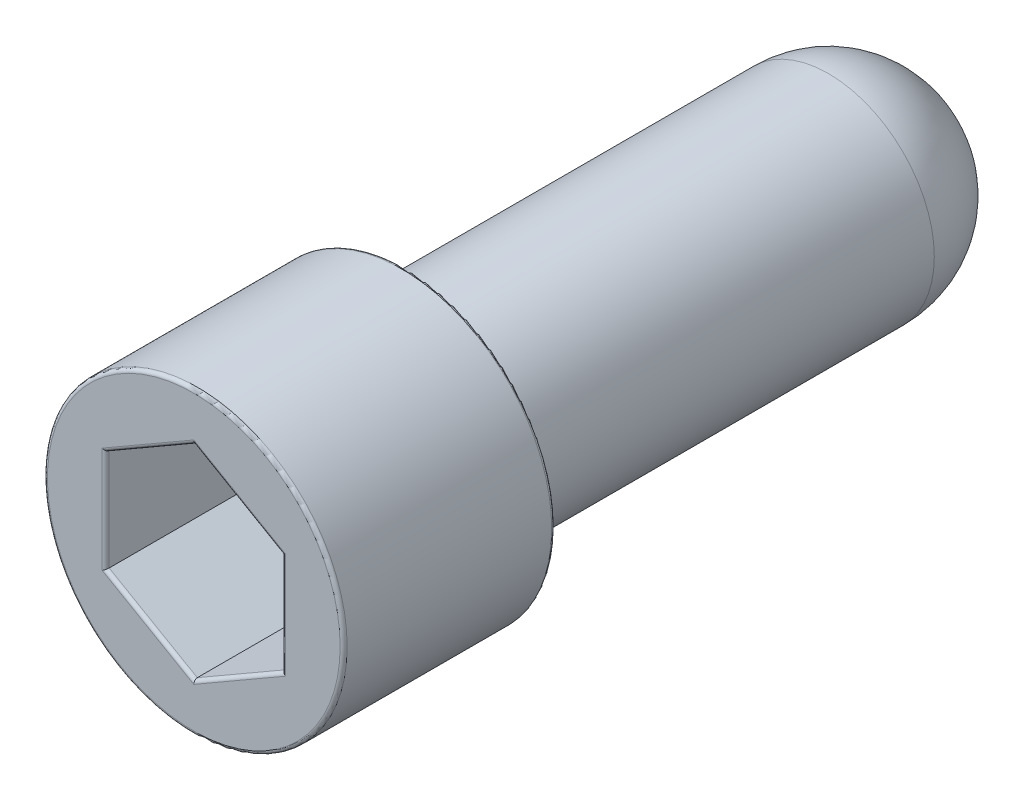
ISO-10303-21;
HEADER;
FILE_DESCRIPTION(('STEP AP214'),'2;1');
FILE_NAME('part.step','',(''),(''),'','','');
FILE_SCHEMA(('AUTOMOTIVE_DESIGN { 1 0 10303 214 1 1 1 1 }'));
ENDSEC;
DATA;
#1=APPLICATION_CONTEXT('core data for automotive mechanical design processes');
#2=APPLICATION_PROTOCOL_DEFINITION('international standard','automotive_design',2000,#1);
#3=PRODUCT_CONTEXT('',#1,'mechanical');
#4=PRODUCT('Part','Part','',(#3));
#5=PRODUCT_RELATED_PRODUCT_CATEGORY('part','',(#4));
#6=PRODUCT_DEFINITION_FORMATION('','',#4);
#7=PRODUCT_DEFINITION_CONTEXT('part definition',#1,'design');
#8=PRODUCT_DEFINITION('design','',#6,#7);
#9=PRODUCT_DEFINITION_SHAPE('','',#8);
#10=(LENGTH_UNIT() NAMED_UNIT(*) SI_UNIT(.MILLI.,.METRE.));
#11=(NAMED_UNIT(*) PLANE_ANGLE_UNIT() SI_UNIT($,.RADIAN.));
#12=(NAMED_UNIT(*) SI_UNIT($,.STERADIAN.) SOLID_ANGLE_UNIT());
#13=UNCERTAINTY_MEASURE_WITH_UNIT(LENGTH_MEASURE(1.E-05),#10,'distance_accuracy_value','');
#14=(GEOMETRIC_REPRESENTATION_CONTEXT(3) GLOBAL_UNCERTAINTY_ASSIGNED_CONTEXT((#13)) GLOBAL_UNIT_ASSIGNED_CONTEXT((#10,
#11,#12)) REPRESENTATION_CONTEXT('',''));
#15=CARTESIAN_POINT('',(0.,0.,0.));
#16=DIRECTION('',(0.,0.,1.));
#17=DIRECTION('',(1.,0.,0.));
#18=AXIS2_PLACEMENT_3D('',#15,#16,#17);
#19=CARTESIAN_POINT('',(0.,0.,6.));
#20=DIRECTION('',(0.,0.,-1.));
#21=DIRECTION('',(-1.,0.,0.));
#22=AXIS2_PLACEMENT_3D('',#19,#20,#21);
#23=CYLINDRICAL_SURFACE('',#22,4.25);
#24=CARTESIAN_POINT('',(0.,0.,5.9));
#25=DIRECTION('',(0.,0.,1.));
#26=DIRECTION('',(1.,0.,0.));
#27=AXIS2_PLACEMENT_3D('',#24,#25,#26);
#28=CIRCLE('',#27,4.25);
#29=CARTESIAN_POINT('',(4.25,0.,5.9));
#30=VERTEX_POINT('',#29);
#31=EDGE_CURVE('E184',#30,#30,#28,.F.);
#32=ORIENTED_EDGE('',*,*,#31,.T.);
#33=EDGE_LOOP('',(#32));
#34=FACE_BOUND('',#33,.T.);
#35=CARTESIAN_POINT('',(0.,0.,0.1));
#36=DIRECTION('',(0.,0.,1.));
#37=DIRECTION('',(1.,0.,0.));
#38=AXIS2_PLACEMENT_3D('',#35,#36,#37);
#39=CIRCLE('',#38,4.25);
#40=CARTESIAN_POINT('',(4.25,0.,0.1));
#41=VERTEX_POINT('',#40);
#42=EDGE_CURVE('E181',#41,#41,#39,.T.);
#43=ORIENTED_EDGE('',*,*,#42,.T.);
#44=EDGE_LOOP('',(#43));
#45=FACE_BOUND('',#44,.T.);
#46=ADVANCED_FACE('F36',(#34,#45),#23,.T.);
#47=CARTESIAN_POINT('',(0.,0.,6.));
#48=DIRECTION('',(0.,0.,1.));
#49=DIRECTION('',(1.,0.,0.));
#50=AXIS2_PLACEMENT_3D('',#47,#48,#49);
#51=PLANE('',#50);
#52=DIRECTION('',(-0.866025403784439,-0.5,0.));
#53=VECTOR('',#52,1.);
#54=CARTESIAN_POINT('',(-0.0499999999999998,2.97335388632657,6.));
#55=LINE('',#54,#53);
#56=CARTESIAN_POINT('',(-2.6,1.50111069989303,6.));
#57=VERTEX_POINT('',#56);
#58=CARTESIAN_POINT('',(0.,3.00222139978605,6.));
#59=VERTEX_POINT('',#58);
#60=EDGE_CURVE('E160',#57,#59,#55,.F.);
#61=ORIENTED_EDGE('',*,*,#60,.T.);
#62=DIRECTION('',(-0.866025403784439,0.5,0.));
#63=VECTOR('',#62,1.);
#64=CARTESIAN_POINT('',(2.55,1.52997821335251,6.));
#65=LINE('',#64,#63);
#66=CARTESIAN_POINT('',(2.6,1.50111069989303,6.));
#67=VERTEX_POINT('',#66);
#68=EDGE_CURVE('E170',#59,#67,#65,.F.);
#69=ORIENTED_EDGE('',*,*,#68,.T.);
#70=DIRECTION('',(0.,1.,0.));
#71=VECTOR('',#70,1.);
#72=CARTESIAN_POINT('',(2.6,-1.44337567297406,6.));
#73=LINE('',#72,#71);
#74=CARTESIAN_POINT('',(2.6,-1.50111069989303,6.));
#75=VERTEX_POINT('',#74);
#76=EDGE_CURVE('E168',#67,#75,#73,.F.);
#77=ORIENTED_EDGE('',*,*,#76,.T.);
#78=DIRECTION('',(0.866025403784439,0.5,0.));
#79=VECTOR('',#78,1.);
#80=CARTESIAN_POINT('',(0.0499999999999995,-2.97335388632657,6.));
#81=LINE('',#80,#79);
#82=CARTESIAN_POINT('',(0.,-3.00222139978605,6.));
#83=VERTEX_POINT('',#82);
#84=EDGE_CURVE('E166',#75,#83,#81,.F.);
#85=ORIENTED_EDGE('',*,*,#84,.T.);
#86=DIRECTION('',(0.866025403784439,-0.5,0.));
#87=VECTOR('',#86,1.);
#88=CARTESIAN_POINT('',(-2.55,-1.52997821335251,6.));
#89=LINE('',#88,#87);
#90=CARTESIAN_POINT('',(-2.6,-1.50111069989303,6.));
#91=VERTEX_POINT('',#90);
#92=EDGE_CURVE('E164',#83,#91,#89,.F.);
#93=ORIENTED_EDGE('',*,*,#92,.T.);
#94=DIRECTION('',(0.,-1.,0.));
#95=VECTOR('',#94,1.);
#96=CARTESIAN_POINT('',(-2.6,1.44337567297406,6.));
#97=LINE('',#96,#95);
#98=EDGE_CURVE('E162',#91,#57,#97,.F.);
#99=ORIENTED_EDGE('',*,*,#98,.T.);
#100=EDGE_LOOP('',(#61,#69,#77,#85,#93,#99));
#101=FACE_BOUND('',#100,.T.);
#102=CARTESIAN_POINT('',(0.,0.,6.));
#103=DIRECTION('',(0.,0.,1.));
#104=DIRECTION('',(1.,0.,0.));
#105=AXIS2_PLACEMENT_3D('',#102,#103,#104);
#106=CIRCLE('',#105,4.15);
#107=CARTESIAN_POINT('',(4.15,0.,6.));
#108=VERTEX_POINT('',#107);
#109=EDGE_CURVE('E157',#108,#108,#106,.T.);
#110=ORIENTED_EDGE('',*,*,#109,.T.);
#111=EDGE_LOOP('',(#110));
#112=FACE_BOUND('',#111,.T.);
#113=ADVANCED_FACE('F227',(#101,#112),#51,.T.);
#114=CARTESIAN_POINT('',(0.,0.,0.));
#115=DIRECTION('',(0.,0.,1.));
#116=DIRECTION('',(1.,0.,0.));
#117=AXIS2_PLACEMENT_3D('',#114,#115,#116);
#118=PLANE('',#117);
#119=CARTESIAN_POINT('',(0.,0.,0.));
#120=DIRECTION('',(0.,0.,1.));
#121=DIRECTION('',(1.,0.,0.));
#122=AXIS2_PLACEMENT_3D('',#119,#120,#121);
#123=CIRCLE('',#122,4.15);
#124=CARTESIAN_POINT('',(4.15,0.,0.));
#125=VERTEX_POINT('',#124);
#126=EDGE_CURVE('E44',#125,#125,#123,.F.);
#127=ORIENTED_EDGE('',*,*,#126,.T.);
#128=EDGE_LOOP('',(#127));
#129=FACE_BOUND('',#128,.T.);
#130=CARTESIAN_POINT('',(0.,0.,0.));
#131=DIRECTION('',(0.,0.,-1.));
#132=DIRECTION('',(-1.,0.,0.));
#133=AXIS2_PLACEMENT_3D('',#130,#131,#132);
#134=CIRCLE('',#133,3.);
#135=CARTESIAN_POINT('',(-3.,0.,0.));
#136=VERTEX_POINT('',#135);
#137=EDGE_CURVE('E136',#136,#136,#134,.T.);
#138=ORIENTED_EDGE('',*,*,#137,.F.);
#139=EDGE_LOOP('',(#138));
#140=FACE_BOUND('',#139,.T.);
#141=ADVANCED_FACE('F233',(#129,#140),#118,.F.);
#142=CARTESIAN_POINT('',(2.5,1.44337567297407,2.));
#143=DIRECTION('',(0.5,0.866025403784439,0.));
#144=DIRECTION('',(-0.866025403784439,0.5,0.));
#145=AXIS2_PLACEMENT_3D('',#142,#143,#144);
#146=PLANE('',#145);
#147=DIRECTION('',(0.,0.,1.));
#148=VECTOR('',#147,1.);
#149=CARTESIAN_POINT('',(2.5,1.44337567297407,2.));
#150=LINE('',#149,#148);
#151=CARTESIAN_POINT('',(2.5,1.44337567297407,2.));
#152=VERTEX_POINT('',#151);
#153=CARTESIAN_POINT('',(2.5,1.44337567297407,5.9));
#154=VERTEX_POINT('',#153);
#155=EDGE_CURVE('E145',#152,#154,#150,.T.);
#156=ORIENTED_EDGE('',*,*,#155,.T.);
#157=DIRECTION('',(-0.866025403784439,0.5,0.));
#158=VECTOR('',#157,1.);
#159=CARTESIAN_POINT('',(0.,2.88675134594813,5.9));
#160=LINE('',#159,#158);
#161=CARTESIAN_POINT('',(0.,2.88675134594813,5.9));
#162=VERTEX_POINT('',#161);
#163=EDGE_CURVE('E116',#154,#162,#160,.T.);
#164=ORIENTED_EDGE('',*,*,#163,.T.);
#165=DIRECTION('',(0.,0.,1.));
#166=VECTOR('',#165,1.);
#167=CARTESIAN_POINT('',(0.,2.88675134594813,2.));
#168=LINE('',#167,#166);
#169=CARTESIAN_POINT('',(0.,2.88675134594813,2.));
#170=VERTEX_POINT('',#169);
#171=EDGE_CURVE('E108',#170,#162,#168,.T.);
#172=ORIENTED_EDGE('',*,*,#171,.F.);
#173=DIRECTION('',(-0.866025403784439,0.5,0.));
#174=VECTOR('',#173,1.);
#175=CARTESIAN_POINT('',(2.5,1.44337567297407,2.));
#176=LINE('',#175,#174);
#177=EDGE_CURVE('E113',#152,#170,#176,.T.);
#178=ORIENTED_EDGE('',*,*,#177,.F.);
#179=EDGE_LOOP('',(#156,#164,#172,#178));
#180=FACE_BOUND('',#179,.T.);
#181=ADVANCED_FACE('F111',(#180),#146,.F.);
#182=CARTESIAN_POINT('',(2.5,-1.44337567297406,2.));
#183=DIRECTION('',(1.,0.,0.));
#184=DIRECTION('',(0.,0.,-1.));
#185=AXIS2_PLACEMENT_3D('',#182,#183,#184);
#186=PLANE('',#185);
#187=DIRECTION('',(0.,0.,1.));
#188=VECTOR('',#187,1.);
#189=CARTESIAN_POINT('',(2.5,-1.44337567297406,2.));
#190=LINE('',#189,#188);
#191=CARTESIAN_POINT('',(2.5,-1.44337567297406,2.));
#192=VERTEX_POINT('',#191);
#193=CARTESIAN_POINT('',(2.5,-1.44337567297406,5.9));
#194=VERTEX_POINT('',#193);
#195=EDGE_CURVE('E147',#192,#194,#190,.T.);
#196=ORIENTED_EDGE('',*,*,#195,.T.);
#197=DIRECTION('',(0.,1.,0.));
#198=VECTOR('',#197,1.);
#199=CARTESIAN_POINT('',(2.5,1.44337567297407,5.9));
#200=LINE('',#199,#198);
#201=EDGE_CURVE('E173',#194,#154,#200,.T.);
#202=ORIENTED_EDGE('',*,*,#201,.T.);
#203=ORIENTED_EDGE('',*,*,#155,.F.);
#204=DIRECTION('',(0.,1.,0.));
#205=VECTOR('',#204,1.);
#206=CARTESIAN_POINT('',(2.5,-1.44337567297406,2.));
#207=LINE('',#206,#205);
#208=EDGE_CURVE('E118',#192,#152,#207,.T.);
#209=ORIENTED_EDGE('',*,*,#208,.F.);
#210=EDGE_LOOP('',(#196,#202,#203,#209));
#211=FACE_BOUND('',#210,.T.);
#212=ADVANCED_FACE('F287',(#211),#186,.F.);
#213=CARTESIAN_POINT('',(0.,-2.88675134594813,2.));
#214=DIRECTION('',(0.5,-0.866025403784439,0.));
#215=DIRECTION('',(0.866025403784439,0.5,0.));
#216=AXIS2_PLACEMENT_3D('',#213,#214,#215);
#217=PLANE('',#216);
#218=DIRECTION('',(0.,0.,1.));
#219=VECTOR('',#218,1.);
#220=CARTESIAN_POINT('',(0.,-2.88675134594813,2.));
#221=LINE('',#220,#219);
#222=CARTESIAN_POINT('',(0.,-2.88675134594813,2.));
#223=VERTEX_POINT('',#222);
#224=CARTESIAN_POINT('',(0.,-2.88675134594813,5.9));
#225=VERTEX_POINT('',#224);
#226=EDGE_CURVE('E150',#223,#225,#221,.T.);
#227=ORIENTED_EDGE('',*,*,#226,.T.);
#228=DIRECTION('',(0.866025403784439,0.5,0.));
#229=VECTOR('',#228,1.);
#230=CARTESIAN_POINT('',(2.5,-1.44337567297406,5.9));
#231=LINE('',#230,#229);
#232=EDGE_CURVE('E175',#225,#194,#231,.T.);
#233=ORIENTED_EDGE('',*,*,#232,.T.);
#234=ORIENTED_EDGE('',*,*,#195,.F.);
#235=DIRECTION('',(0.866025403784439,0.5,0.));
#236=VECTOR('',#235,1.);
#237=CARTESIAN_POINT('',(0.,-2.88675134594813,2.));
#238=LINE('',#237,#236);
#239=EDGE_CURVE('E142',#223,#192,#238,.T.);
#240=ORIENTED_EDGE('',*,*,#239,.F.);
#241=EDGE_LOOP('',(#227,#233,#234,#240));
#242=FACE_BOUND('',#241,.T.);
#243=ADVANCED_FACE('F216',(#242),#217,.F.);
#244=CARTESIAN_POINT('',(-2.5,-1.44337567297406,2.));
#245=DIRECTION('',(-0.5,-0.866025403784439,0.));
#246=DIRECTION('',(0.866025403784439,-0.5,0.));
#247=AXIS2_PLACEMENT_3D('',#244,#245,#246);
#248=PLANE('',#247);
#249=DIRECTION('',(0.,0.,1.));
#250=VECTOR('',#249,1.);
#251=CARTESIAN_POINT('',(-2.5,-1.44337567297406,2.));
#252=LINE('',#251,#250);
#253=CARTESIAN_POINT('',(-2.5,-1.44337567297406,2.));
#254=VERTEX_POINT('',#253);
#255=CARTESIAN_POINT('',(-2.5,-1.44337567297406,5.9));
#256=VERTEX_POINT('',#255);
#257=EDGE_CURVE('E153',#254,#256,#252,.T.);
#258=ORIENTED_EDGE('',*,*,#257,.T.);
#259=DIRECTION('',(0.866025403784439,-0.5,0.));
#260=VECTOR('',#259,1.);
#261=CARTESIAN_POINT('',(0.,-2.88675134594813,5.9));
#262=LINE('',#261,#260);
#263=EDGE_CURVE('E177',#256,#225,#262,.T.);
#264=ORIENTED_EDGE('',*,*,#263,.T.);
#265=ORIENTED_EDGE('',*,*,#226,.F.);
#266=DIRECTION('',(0.866025403784439,-0.5,0.));
#267=VECTOR('',#266,1.);
#268=CARTESIAN_POINT('',(-2.5,-1.44337567297406,2.));
#269=LINE('',#268,#267);
#270=EDGE_CURVE('E139',#254,#223,#269,.T.);
#271=ORIENTED_EDGE('',*,*,#270,.F.);
#272=EDGE_LOOP('',(#258,#264,#265,#271));
#273=FACE_BOUND('',#272,.T.);
#274=ADVANCED_FACE('F212',(#273),#248,.F.);
#275=CARTESIAN_POINT('',(-2.5,1.44337567297406,2.));
#276=DIRECTION('',(-1.,0.,0.));
#277=DIRECTION('',(0.,0.,1.));
#278=AXIS2_PLACEMENT_3D('',#275,#276,#277);
#279=PLANE('',#278);
#280=DIRECTION('',(0.,0.,1.));
#281=VECTOR('',#280,1.);
#282=CARTESIAN_POINT('',(-2.5,1.44337567297406,2.));
#283=LINE('',#282,#281);
#284=CARTESIAN_POINT('',(-2.5,1.44337567297406,2.));
#285=VERTEX_POINT('',#284);
#286=CARTESIAN_POINT('',(-2.5,1.44337567297406,5.9));
#287=VERTEX_POINT('',#286);
#288=EDGE_CURVE('E117',#285,#287,#283,.T.);
#289=ORIENTED_EDGE('',*,*,#288,.T.);
#290=DIRECTION('',(0.,-1.,0.));
#291=VECTOR('',#290,1.);
#292=CARTESIAN_POINT('',(-2.5,-1.44337567297406,5.9));
#293=LINE('',#292,#291);
#294=EDGE_CURVE('E58',#287,#256,#293,.T.);
#295=ORIENTED_EDGE('',*,*,#294,.T.);
#296=ORIENTED_EDGE('',*,*,#257,.F.);
#297=DIRECTION('',(0.,-1.,0.));
#298=VECTOR('',#297,1.);
#299=CARTESIAN_POINT('',(-2.5,1.44337567297406,2.));
#300=LINE('',#299,#298);
#301=EDGE_CURVE('E126',#285,#254,#300,.T.);
#302=ORIENTED_EDGE('',*,*,#301,.F.);
#303=EDGE_LOOP('',(#289,#295,#296,#302));
#304=FACE_BOUND('',#303,.T.);
#305=ADVANCED_FACE('F217',(#304),#279,.F.);
#306=CARTESIAN_POINT('',(0.,2.88675134594813,2.));
#307=DIRECTION('',(-0.5,0.866025403784439,0.));
#308=DIRECTION('',(-0.866025403784439,-0.5,0.));
#309=AXIS2_PLACEMENT_3D('',#306,#307,#308);
#310=PLANE('',#309);
#311=ORIENTED_EDGE('',*,*,#171,.T.);
#312=DIRECTION('',(-0.866025403784439,-0.5,0.));
#313=VECTOR('',#312,1.);
#314=CARTESIAN_POINT('',(-2.5,1.44337567297406,5.9));
#315=LINE('',#314,#313);
#316=EDGE_CURVE('E51',#162,#287,#315,.T.);
#317=ORIENTED_EDGE('',*,*,#316,.T.);
#318=ORIENTED_EDGE('',*,*,#288,.F.);
#319=DIRECTION('',(-0.866025403784439,-0.5,0.));
#320=VECTOR('',#319,1.);
#321=CARTESIAN_POINT('',(0.,2.88675134594813,2.));
#322=LINE('',#321,#320);
#323=EDGE_CURVE('E121',#170,#285,#322,.T.);
#324=ORIENTED_EDGE('',*,*,#323,.F.);
#325=EDGE_LOOP('',(#311,#317,#318,#324));
#326=FACE_BOUND('',#325,.T.);
#327=ADVANCED_FACE('F122',(#326),#310,.F.);
#328=CARTESIAN_POINT('',(0.,0.,2.));
#329=DIRECTION('',(0.,0.,1.));
#330=DIRECTION('',(1.,0.,0.));
#331=AXIS2_PLACEMENT_3D('',#328,#329,#330);
#332=PLANE('',#331);
#333=ORIENTED_EDGE('',*,*,#177,.T.);
#334=ORIENTED_EDGE('',*,*,#323,.T.);
#335=ORIENTED_EDGE('',*,*,#301,.T.);
#336=ORIENTED_EDGE('',*,*,#270,.T.);
#337=ORIENTED_EDGE('',*,*,#239,.T.);
#338=ORIENTED_EDGE('',*,*,#208,.T.);
#339=EDGE_LOOP('',(#333,#334,#335,#336,#337,#338));
#340=FACE_BOUND('',#339,.T.);
#341=ADVANCED_FACE('F128',(#340),#332,.T.);
#342=CARTESIAN_POINT('',(0.,0.,-15.));
#343=DIRECTION('',(0.,0.,1.));
#344=DIRECTION('',(1.,0.,0.));
#345=AXIS2_PLACEMENT_3D('',#342,#343,#344);
#346=CYLINDRICAL_SURFACE('',#345,3.);
#347=CARTESIAN_POINT('',(0.,0.,-12.));
#348=DIRECTION('',(0.,0.,1.));
#349=DIRECTION('',(1.,0.,0.));
#350=AXIS2_PLACEMENT_3D('',#347,#348,#349);
#351=CIRCLE('',#350,3.);
#352=CARTESIAN_POINT('',(3.,0.,-12.));
#353=VERTEX_POINT('',#352);
#354=EDGE_CURVE('E11',#353,#353,#351,.T.);
#355=ORIENTED_EDGE('',*,*,#354,.T.);
#356=EDGE_LOOP('',(#355));
#357=FACE_BOUND('',#356,.T.);
#358=ORIENTED_EDGE('',*,*,#137,.T.);
#359=EDGE_LOOP('',(#358));
#360=FACE_BOUND('',#359,.T.);
#361=ADVANCED_FACE('F260',(#357,#360),#346,.T.);
#362=CARTESIAN_POINT('',(-2.55,-1.52997821335251,5.9));
#363=DIRECTION('',(-0.866025403784439,0.5,0.));
#364=DIRECTION('',(-0.5,-0.866025403784439,0.));
#365=AXIS2_PLACEMENT_3D('',#362,#363,#364);
#366=CYLINDRICAL_SURFACE('',#365,0.1);
#367=CARTESIAN_POINT('',(-2.6,-1.50111069989303,5.9));
#368=DIRECTION('',(-0.5,0.866025403784439,0.));
#369=DIRECTION('',(-0.866025403784439,-0.5,0.));
#370=AXIS2_PLACEMENT_3D('',#367,#368,#369);
#371=ELLIPSE('',#370,0.115470053837925,0.1);
#372=EDGE_CURVE('E134',#91,#256,#371,.T.);
#373=ORIENTED_EDGE('',*,*,#372,.F.);
#374=ORIENTED_EDGE('',*,*,#92,.F.);
#375=CARTESIAN_POINT('',(0.,-3.00222139978605,5.9));
#376=DIRECTION('',(-1.,0.,0.));
#377=DIRECTION('',(0.,-1.,0.));
#378=AXIS2_PLACEMENT_3D('',#375,#376,#377);
#379=ELLIPSE('',#378,0.115470053837925,0.1);
#380=EDGE_CURVE('E131',#225,#83,#379,.F.);
#381=ORIENTED_EDGE('',*,*,#380,.F.);
#382=ORIENTED_EDGE('',*,*,#263,.F.);
#383=EDGE_LOOP('',(#373,#374,#381,#382));
#384=FACE_BOUND('',#383,.T.);
#385=ADVANCED_FACE('F208',(#384),#366,.T.);
#386=CARTESIAN_POINT('',(0.0499999999999996,-2.97335388632657,5.9));
#387=DIRECTION('',(-0.866025403784439,-0.5,0.));
#388=DIRECTION('',(0.5,-0.866025403784439,0.));
#389=AXIS2_PLACEMENT_3D('',#386,#387,#388);
#390=CYLINDRICAL_SURFACE('',#389,0.1);
#391=ORIENTED_EDGE('',*,*,#380,.T.);
#392=ORIENTED_EDGE('',*,*,#84,.F.);
#393=CARTESIAN_POINT('',(2.6,-1.50111069989303,5.9));
#394=DIRECTION('',(-0.5,-0.866025403784439,0.));
#395=DIRECTION('',(0.866025403784439,-0.5,0.));
#396=AXIS2_PLACEMENT_3D('',#393,#394,#395);
#397=ELLIPSE('',#396,0.115470053837925,0.1);
#398=EDGE_CURVE('E196',#194,#75,#397,.F.);
#399=ORIENTED_EDGE('',*,*,#398,.F.);
#400=ORIENTED_EDGE('',*,*,#232,.F.);
#401=EDGE_LOOP('',(#391,#392,#399,#400));
#402=FACE_BOUND('',#401,.T.);
#403=ADVANCED_FACE('F254',(#402),#390,.T.);
#404=CARTESIAN_POINT('',(-2.6,1.44337567297406,5.9));
#405=DIRECTION('',(0.,1.,0.));
#406=DIRECTION('',(0.,0.,1.));
#407=AXIS2_PLACEMENT_3D('',#404,#405,#406);
#408=CYLINDRICAL_SURFACE('',#407,0.1);
#409=ORIENTED_EDGE('',*,*,#372,.T.);
#410=ORIENTED_EDGE('',*,*,#294,.F.);
#411=CARTESIAN_POINT('',(-2.6,1.50111069989303,5.9));
#412=DIRECTION('',(0.5,0.866025403784439,0.));
#413=DIRECTION('',(-0.866025403784439,0.5,0.));
#414=AXIS2_PLACEMENT_3D('',#411,#412,#413);
#415=ELLIPSE('',#414,0.115470053837925,0.1);
#416=EDGE_CURVE('E193',#57,#287,#415,.T.);
#417=ORIENTED_EDGE('',*,*,#416,.F.);
#418=ORIENTED_EDGE('',*,*,#98,.F.);
#419=EDGE_LOOP('',(#409,#410,#417,#418));
#420=FACE_BOUND('',#419,.T.);
#421=ADVANCED_FACE('F203',(#420),#408,.T.);
#422=CARTESIAN_POINT('',(2.6,-1.44337567297406,5.9));
#423=DIRECTION('',(0.,-1.,0.));
#424=DIRECTION('',(0.,0.,-1.));
#425=AXIS2_PLACEMENT_3D('',#422,#423,#424);
#426=CYLINDRICAL_SURFACE('',#425,0.1);
#427=ORIENTED_EDGE('',*,*,#398,.T.);
#428=ORIENTED_EDGE('',*,*,#76,.F.);
#429=CARTESIAN_POINT('',(2.6,1.50111069989303,5.9));
#430=DIRECTION('',(0.5,-0.866025403784439,0.));
#431=DIRECTION('',(0.866025403784439,0.5,0.));
#432=AXIS2_PLACEMENT_3D('',#429,#430,#431);
#433=ELLIPSE('',#432,0.115470053837925,0.1);
#434=EDGE_CURVE('E191',#154,#67,#433,.F.);
#435=ORIENTED_EDGE('',*,*,#434,.F.);
#436=ORIENTED_EDGE('',*,*,#201,.F.);
#437=EDGE_LOOP('',(#427,#428,#435,#436));
#438=FACE_BOUND('',#437,.T.);
#439=ADVANCED_FACE('F247',(#438),#426,.T.);
#440=CARTESIAN_POINT('',(-0.0499999999999996,2.97335388632657,5.9));
#441=DIRECTION('',(0.866025403784439,0.5,0.));
#442=DIRECTION('',(-0.5,0.866025403784439,0.));
#443=AXIS2_PLACEMENT_3D('',#440,#441,#442);
#444=CYLINDRICAL_SURFACE('',#443,0.1);
#445=ORIENTED_EDGE('',*,*,#416,.T.);
#446=ORIENTED_EDGE('',*,*,#316,.F.);
#447=CARTESIAN_POINT('',(0.,3.00222139978605,5.9));
#448=DIRECTION('',(1.,0.,0.));
#449=DIRECTION('',(0.,-1.,0.));
#450=AXIS2_PLACEMENT_3D('',#447,#448,#449);
#451=ELLIPSE('',#450,0.115470053837925,0.1);
#452=EDGE_CURVE('E189',#59,#162,#451,.T.);
#453=ORIENTED_EDGE('',*,*,#452,.F.);
#454=ORIENTED_EDGE('',*,*,#60,.F.);
#455=EDGE_LOOP('',(#445,#446,#453,#454));
#456=FACE_BOUND('',#455,.T.);
#457=ADVANCED_FACE('F243',(#456),#444,.T.);
#458=CARTESIAN_POINT('',(2.55,1.52997821335251,5.9));
#459=DIRECTION('',(0.866025403784439,-0.5,0.));
#460=DIRECTION('',(0.5,0.866025403784439,0.));
#461=AXIS2_PLACEMENT_3D('',#458,#459,#460);
#462=CYLINDRICAL_SURFACE('',#461,0.1);
#463=ORIENTED_EDGE('',*,*,#434,.T.);
#464=ORIENTED_EDGE('',*,*,#68,.F.);
#465=ORIENTED_EDGE('',*,*,#452,.T.);
#466=ORIENTED_EDGE('',*,*,#163,.F.);
#467=EDGE_LOOP('',(#463,#464,#465,#466));
#468=FACE_BOUND('',#467,.T.);
#469=ADVANCED_FACE('F239',(#468),#462,.T.);
#470=CARTESIAN_POINT('',(0.,0.,5.9));
#471=DIRECTION('',(0.,0.,1.));
#472=DIRECTION('',(1.,0.,0.));
#473=AXIS2_PLACEMENT_3D('',#470,#471,#472);
#474=TOROIDAL_SURFACE('',#473,4.15,0.1);
#475=ORIENTED_EDGE('',*,*,#31,.F.);
#476=EDGE_LOOP('',(#475));
#477=FACE_BOUND('',#476,.T.);
#478=ORIENTED_EDGE('',*,*,#109,.F.);
#479=EDGE_LOOP('',(#478));
#480=FACE_BOUND('',#479,.T.);
#481=ADVANCED_FACE('F242',(#477,#480),#474,.T.);
#482=CARTESIAN_POINT('',(0.,0.,0.1));
#483=DIRECTION('',(0.,0.,1.));
#484=DIRECTION('',(1.,0.,0.));
#485=AXIS2_PLACEMENT_3D('',#482,#483,#484);
#486=TOROIDAL_SURFACE('',#485,4.15,0.1);
#487=ORIENTED_EDGE('',*,*,#126,.F.);
#488=EDGE_LOOP('',(#487));
#489=FACE_BOUND('',#488,.T.);
#490=ORIENTED_EDGE('',*,*,#42,.F.);
#491=EDGE_LOOP('',(#490));
#492=FACE_BOUND('',#491,.T.);
#493=ADVANCED_FACE('F262',(#489,#492),#486,.T.);
#494=CARTESIAN_POINT('',(0.,0.,-12.));
#495=DIRECTION('',(0.,0.,-1.));
#496=DIRECTION('',(-1.,0.,0.));
#497=AXIS2_PLACEMENT_3D('',#494,#495,#496);
#498=SPHERICAL_SURFACE('',#497,3.);
#499=ORIENTED_EDGE('',*,*,#354,.F.);
#500=EDGE_LOOP('',(#499));
#501=FACE_BOUND('',#500,.T.);
#502=ADVANCED_FACE('F38',(#501),#498,.T.);
#503=CLOSED_SHELL('',(#46,#113,#141,#181,#212,#243,#274,#305,#327,#341,#361,#385,#403,#421,#439,
#457,#469,#481,#493,#502));
#504=MANIFOLD_SOLID_BREP('B2',#503);
#505=ADVANCED_BREP_SHAPE_REPRESENTATION('',(#18,#504),#14);
#506=SHAPE_DEFINITION_REPRESENTATION(#9,#505);
ENDSEC;
END-ISO-10303-21;
